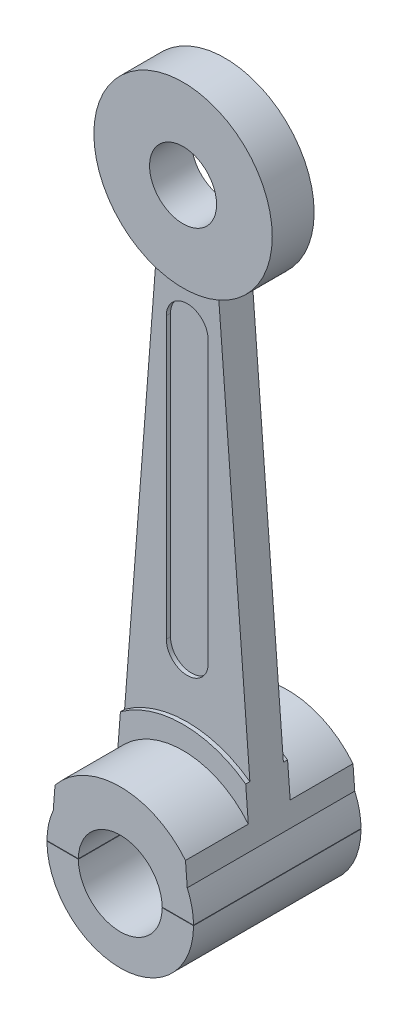
ISO-10303-21;
HEADER;
FILE_DESCRIPTION(('STEP AP214'),'2;1');
FILE_NAME('part.step','',(''),(''),'','','');
FILE_SCHEMA(('AUTOMOTIVE_DESIGN { 1 0 10303 214 1 1 1 1 }'));
ENDSEC;
DATA;
#1=APPLICATION_CONTEXT('core data for automotive mechanical design processes');
#2=APPLICATION_PROTOCOL_DEFINITION('international standard','automotive_design',2000,#1);
#3=PRODUCT_CONTEXT('',#1,'mechanical');
#4=PRODUCT('Part','Part','',(#3));
#5=PRODUCT_RELATED_PRODUCT_CATEGORY('part','',(#4));
#6=PRODUCT_DEFINITION_FORMATION('','',#4);
#7=PRODUCT_DEFINITION_CONTEXT('part definition',#1,'design');
#8=PRODUCT_DEFINITION('design','',#6,#7);
#9=PRODUCT_DEFINITION_SHAPE('','',#8);
#10=(LENGTH_UNIT() NAMED_UNIT(*) SI_UNIT(.MILLI.,.METRE.));
#11=(NAMED_UNIT(*) PLANE_ANGLE_UNIT() SI_UNIT($,.RADIAN.));
#12=(NAMED_UNIT(*) SI_UNIT($,.STERADIAN.) SOLID_ANGLE_UNIT());
#13=UNCERTAINTY_MEASURE_WITH_UNIT(LENGTH_MEASURE(1.E-05),#10,'distance_accuracy_value','');
#14=(GEOMETRIC_REPRESENTATION_CONTEXT(3) GLOBAL_UNCERTAINTY_ASSIGNED_CONTEXT((#13)) GLOBAL_UNIT_ASSIGNED_CONTEXT((#10,
#11,#12)) REPRESENTATION_CONTEXT('',''));
#15=CARTESIAN_POINT('',(0.,0.,0.));
#16=DIRECTION('',(0.,0.,1.));
#17=DIRECTION('',(1.,0.,0.));
#18=AXIS2_PLACEMENT_3D('',#15,#16,#17);
#19=CARTESIAN_POINT('',(0.,0.,-30.75));
#20=DIRECTION('',(0.,0.,1.));
#21=DIRECTION('',(1.,0.,0.));
#22=AXIS2_PLACEMENT_3D('',#19,#20,#21);
#23=CYLINDRICAL_SURFACE('',#22,1.75);
#24=CARTESIAN_POINT('',(0.,0.,-2.));
#25=DIRECTION('',(0.,0.,1.));
#26=DIRECTION('',(1.,0.,0.));
#27=AXIS2_PLACEMENT_3D('',#24,#25,#26);
#28=CIRCLE('',#27,1.75);
#29=CARTESIAN_POINT('',(-1.74997142833819,0.00999999999999941,-2.));
#30=VERTEX_POINT('',#29);
#31=CARTESIAN_POINT('',(-1.6,0.708872343937891,-2.));
#32=VERTEX_POINT('',#31);
#33=EDGE_CURVE('E266',#30,#32,#28,.F.);
#34=ORIENTED_EDGE('',*,*,#33,.F.);
#35=DIRECTION('',(0.,0.,1.));
#36=VECTOR('',#35,1.);
#37=CARTESIAN_POINT('',(-1.74997142833819,0.00999999999999941,-30.75));
#38=LINE('',#37,#36);
#39=CARTESIAN_POINT('',(-1.74997142833819,0.00999999999999941,2.));
#40=VERTEX_POINT('',#39);
#41=EDGE_CURVE('E301',#30,#40,#38,.T.);
#42=ORIENTED_EDGE('',*,*,#41,.T.);
#43=CARTESIAN_POINT('',(0.,0.,2.));
#44=DIRECTION('',(0.,0.,1.));
#45=DIRECTION('',(1.,0.,0.));
#46=AXIS2_PLACEMENT_3D('',#43,#44,#45);
#47=CIRCLE('',#46,1.75);
#48=CARTESIAN_POINT('',(-1.6,0.708872343937891,2.));
#49=VERTEX_POINT('',#48);
#50=EDGE_CURVE('E254',#40,#49,#47,.F.);
#51=ORIENTED_EDGE('',*,*,#50,.T.);
#52=DIRECTION('',(0.,0.,1.));
#53=VECTOR('',#52,1.);
#54=CARTESIAN_POINT('',(-1.6,0.708872343937891,-30.75));
#55=LINE('',#54,#53);
#56=EDGE_CURVE('E264',#32,#49,#55,.T.);
#57=ORIENTED_EDGE('',*,*,#56,.F.);
#58=EDGE_LOOP('',(#34,#42,#51,#57));
#59=FACE_BOUND('',#58,.T.);
#60=ADVANCED_FACE('F47',(#59),#23,.T.);
#61=CARTESIAN_POINT('',(0.,0.,0.5));
#62=DIRECTION('',(0.,0.,-1.));
#63=DIRECTION('',(-1.,0.,0.));
#64=AXIS2_PLACEMENT_3D('',#61,#62,#63);
#65=CYLINDRICAL_SURFACE('',#64,2.54);
#66=CARTESIAN_POINT('',(0.,0.,0.5));
#67=DIRECTION('',(0.,0.,1.));
#68=DIRECTION('',(1.,0.,0.));
#69=AXIS2_PLACEMENT_3D('',#66,#67,#68);
#70=CIRCLE('',#69,2.54);
#71=CARTESIAN_POINT('',(1.49604331072697,2.05267006906349,0.5));
#72=VERTEX_POINT('',#71);
#73=CARTESIAN_POINT('',(-1.49604331072697,2.05267006906349,0.5));
#74=VERTEX_POINT('',#73);
#75=EDGE_CURVE('E189',#72,#74,#70,.T.);
#76=ORIENTED_EDGE('',*,*,#75,.F.);
#77=DIRECTION('',(0.,0.,-1.));
#78=VECTOR('',#77,1.);
#79=CARTESIAN_POINT('',(1.49604331072697,2.05267006906349,0.5));
#80=LINE('',#79,#78);
#81=CARTESIAN_POINT('',(1.49604331072697,2.05267006906349,0.4));
#82=VERTEX_POINT('',#81);
#83=EDGE_CURVE('E251',#72,#82,#80,.T.);
#84=ORIENTED_EDGE('',*,*,#83,.T.);
#85=CARTESIAN_POINT('',(0.,0.,0.4));
#86=DIRECTION('',(0.,0.,1.));
#87=DIRECTION('',(1.,0.,0.));
#88=AXIS2_PLACEMENT_3D('',#85,#86,#87);
#89=CIRCLE('',#88,2.54);
#90=CARTESIAN_POINT('',(-1.49604331072697,2.05267006906349,0.4));
#91=VERTEX_POINT('',#90);
#92=EDGE_CURVE('E164',#82,#91,#89,.T.);
#93=ORIENTED_EDGE('',*,*,#92,.T.);
#94=DIRECTION('',(0.,0.,-1.));
#95=VECTOR('',#94,1.);
#96=CARTESIAN_POINT('',(-1.49604331072697,2.05267006906349,0.5));
#97=LINE('',#96,#95);
#98=EDGE_CURVE('E131',#91,#74,#97,.F.);
#99=ORIENTED_EDGE('',*,*,#98,.T.);
#100=EDGE_LOOP('',(#76,#84,#93,#99));
#101=FACE_BOUND('',#100,.T.);
#102=ADVANCED_FACE('F453',(#101),#65,.T.);
#103=CARTESIAN_POINT('',(0.,4.,0.4));
#104=DIRECTION('',(0.,0.,-1.));
#105=DIRECTION('',(-1.,0.,0.));
#106=AXIS2_PLACEMENT_3D('',#103,#104,#105);
#107=CYLINDRICAL_SURFACE('',#106,0.5);
#108=DIRECTION('',(0.,0.,-1.));
#109=VECTOR('',#108,1.);
#110=CARTESIAN_POINT('',(-0.499999999999999,4.,0.4));
#111=LINE('',#110,#109);
#112=CARTESIAN_POINT('',(-0.499999999999999,4.,-0.3));
#113=VERTEX_POINT('',#112);
#114=CARTESIAN_POINT('',(-0.499999999999999,4.,-0.4));
#115=VERTEX_POINT('',#114);
#116=EDGE_CURVE('E197',#113,#115,#111,.T.);
#117=ORIENTED_EDGE('',*,*,#116,.F.);
#118=CARTESIAN_POINT('',(0.,4.,-0.3));
#119=DIRECTION('',(0.,0.,1.));
#120=DIRECTION('',(1.,0.,0.));
#121=AXIS2_PLACEMENT_3D('',#118,#119,#120);
#122=CIRCLE('',#121,0.5);
#123=CARTESIAN_POINT('',(0.500000000000001,4.,-0.3));
#124=VERTEX_POINT('',#123);
#125=EDGE_CURVE('E203',#113,#124,#122,.T.);
#126=ORIENTED_EDGE('',*,*,#125,.T.);
#127=DIRECTION('',(0.,0.,-1.));
#128=VECTOR('',#127,1.);
#129=CARTESIAN_POINT('',(0.500000000000001,4.,0.4));
#130=LINE('',#129,#128);
#131=CARTESIAN_POINT('',(0.500000000000001,4.,-0.4));
#132=VERTEX_POINT('',#131);
#133=EDGE_CURVE('E206',#124,#132,#130,.T.);
#134=ORIENTED_EDGE('',*,*,#133,.T.);
#135=CARTESIAN_POINT('',(0.,4.,-0.4));
#136=DIRECTION('',(0.,0.,1.));
#137=DIRECTION('',(1.,0.,0.));
#138=AXIS2_PLACEMENT_3D('',#135,#136,#137);
#139=CIRCLE('',#138,0.5);
#140=EDGE_CURVE('E169',#115,#132,#139,.T.);
#141=ORIENTED_EDGE('',*,*,#140,.F.);
#142=EDGE_LOOP('',(#117,#126,#134,#141));
#143=FACE_BOUND('',#142,.T.);
#144=ADVANCED_FACE('F358',(#143),#107,.F.);
#145=CARTESIAN_POINT('',(-0.499999999999999,0.,0.4));
#146=DIRECTION('',(1.,0.,0.));
#147=DIRECTION('',(0.,1.,0.));
#148=AXIS2_PLACEMENT_3D('',#145,#146,#147);
#149=PLANE('',#148);
#150=DIRECTION('',(0.,0.,-1.));
#151=VECTOR('',#150,1.);
#152=CARTESIAN_POINT('',(-0.5,10.69,0.4));
#153=LINE('',#152,#151);
#154=CARTESIAN_POINT('',(-0.5,10.69,-0.3));
#155=VERTEX_POINT('',#154);
#156=CARTESIAN_POINT('',(-0.5,10.69,-0.4));
#157=VERTEX_POINT('',#156);
#158=EDGE_CURVE('E196',#155,#157,#153,.T.);
#159=ORIENTED_EDGE('',*,*,#158,.F.);
#160=DIRECTION('',(0.,-1.,0.));
#161=VECTOR('',#160,1.);
#162=CARTESIAN_POINT('',(-0.499999999999999,0.,-0.3));
#163=LINE('',#162,#161);
#164=EDGE_CURVE('E207',#155,#113,#163,.T.);
#165=ORIENTED_EDGE('',*,*,#164,.T.);
#166=ORIENTED_EDGE('',*,*,#116,.T.);
#167=DIRECTION('',(0.,-1.,0.));
#168=VECTOR('',#167,1.);
#169=CARTESIAN_POINT('',(-0.499999999999999,0.,-0.4));
#170=LINE('',#169,#168);
#171=EDGE_CURVE('E335',#157,#115,#170,.T.);
#172=ORIENTED_EDGE('',*,*,#171,.F.);
#173=EDGE_LOOP('',(#159,#165,#166,#172));
#174=FACE_BOUND('',#173,.T.);
#175=ADVANCED_FACE('F460',(#174),#149,.T.);
#176=CARTESIAN_POINT('',(0.,10.69,0.4));
#177=DIRECTION('',(0.,0.,-1.));
#178=DIRECTION('',(-1.,0.,0.));
#179=AXIS2_PLACEMENT_3D('',#176,#177,#178);
#180=CYLINDRICAL_SURFACE('',#179,0.5);
#181=DIRECTION('',(0.,0.,-1.));
#182=VECTOR('',#181,1.);
#183=CARTESIAN_POINT('',(0.5,10.69,0.4));
#184=LINE('',#183,#182);
#185=CARTESIAN_POINT('',(0.5,10.69,-0.3));
#186=VERTEX_POINT('',#185);
#187=CARTESIAN_POINT('',(0.5,10.69,-0.4));
#188=VERTEX_POINT('',#187);
#189=EDGE_CURVE('E329',#186,#188,#184,.T.);
#190=ORIENTED_EDGE('',*,*,#189,.F.);
#191=CARTESIAN_POINT('',(0.,10.69,-0.3));
#192=DIRECTION('',(0.,0.,1.));
#193=DIRECTION('',(1.,0.,0.));
#194=AXIS2_PLACEMENT_3D('',#191,#192,#193);
#195=CIRCLE('',#194,0.5);
#196=EDGE_CURVE('E193',#186,#155,#195,.T.);
#197=ORIENTED_EDGE('',*,*,#196,.T.);
#198=ORIENTED_EDGE('',*,*,#158,.T.);
#199=CARTESIAN_POINT('',(0.,10.69,-0.4));
#200=DIRECTION('',(0.,0.,1.));
#201=DIRECTION('',(1.,0.,0.));
#202=AXIS2_PLACEMENT_3D('',#199,#200,#201);
#203=CIRCLE('',#202,0.5);
#204=EDGE_CURVE('E338',#188,#157,#203,.T.);
#205=ORIENTED_EDGE('',*,*,#204,.F.);
#206=EDGE_LOOP('',(#190,#197,#198,#205));
#207=FACE_BOUND('',#206,.T.);
#208=ADVANCED_FACE('F487',(#207),#180,.F.);
#209=CARTESIAN_POINT('',(0.500000000000002,0.,0.4));
#210=DIRECTION('',(1.,0.,0.));
#211=DIRECTION('',(0.,1.,0.));
#212=AXIS2_PLACEMENT_3D('',#209,#210,#211);
#213=PLANE('',#212);
#214=DIRECTION('',(0.,-1.,0.));
#215=VECTOR('',#214,1.);
#216=CARTESIAN_POINT('',(0.500000000000002,0.,-0.3));
#217=LINE('',#216,#215);
#218=EDGE_CURVE('E198',#186,#124,#217,.T.);
#219=ORIENTED_EDGE('',*,*,#218,.F.);
#220=ORIENTED_EDGE('',*,*,#189,.T.);
#221=DIRECTION('',(0.,-1.,0.));
#222=VECTOR('',#221,1.);
#223=CARTESIAN_POINT('',(0.500000000000002,0.,-0.4));
#224=LINE('',#223,#222);
#225=EDGE_CURVE('E160',#188,#132,#224,.T.);
#226=ORIENTED_EDGE('',*,*,#225,.T.);
#227=ORIENTED_EDGE('',*,*,#133,.F.);
#228=EDGE_LOOP('',(#219,#220,#226,#227));
#229=FACE_BOUND('',#228,.T.);
#230=ADVANCED_FACE('F482',(#229),#213,.F.);
#231=CARTESIAN_POINT('',(0.,13.69,0.5));
#232=DIRECTION('',(0.,0.,-1.));
#233=DIRECTION('',(-1.,0.,0.));
#234=AXIS2_PLACEMENT_3D('',#231,#232,#233);
#235=CYLINDRICAL_SURFACE('',#234,0.8);
#236=CARTESIAN_POINT('',(0.,13.69,0.5));
#237=DIRECTION('',(0.,0.,1.));
#238=DIRECTION('',(1.,0.,0.));
#239=AXIS2_PLACEMENT_3D('',#236,#237,#238);
#240=CIRCLE('',#239,0.8);
#241=CARTESIAN_POINT('',(0.8,13.69,0.5));
#242=VERTEX_POINT('',#241);
#243=EDGE_CURVE('E155',#242,#242,#240,.T.);
#244=ORIENTED_EDGE('',*,*,#243,.T.);
#245=EDGE_LOOP('',(#244));
#246=FACE_BOUND('',#245,.T.);
#247=CARTESIAN_POINT('',(0.,13.69,-0.5));
#248=DIRECTION('',(0.,0.,1.));
#249=DIRECTION('',(1.,0.,0.));
#250=AXIS2_PLACEMENT_3D('',#247,#248,#249);
#251=CIRCLE('',#250,0.8);
#252=CARTESIAN_POINT('',(0.8,13.69,-0.5));
#253=VERTEX_POINT('',#252);
#254=EDGE_CURVE('E183',#253,#253,#251,.T.);
#255=ORIENTED_EDGE('',*,*,#254,.F.);
#256=EDGE_LOOP('',(#255));
#257=FACE_BOUND('',#256,.T.);
#258=ADVANCED_FACE('F503',(#246,#257),#235,.F.);
#259=CARTESIAN_POINT('',(0.,13.69,0.5));
#260=DIRECTION('',(0.,0.,-1.));
#261=DIRECTION('',(-1.,0.,0.));
#262=AXIS2_PLACEMENT_3D('',#259,#260,#261);
#263=CYLINDRICAL_SURFACE('',#262,2.13);
#264=CARTESIAN_POINT('',(0.,13.69,0.4));
#265=DIRECTION('',(0.,0.,1.));
#266=DIRECTION('',(1.,0.,0.));
#267=AXIS2_PLACEMENT_3D('',#264,#265,#266);
#268=CIRCLE('',#267,2.13);
#269=CARTESIAN_POINT('',(-0.75,11.6964102728997,0.400000000000001));
#270=VERTEX_POINT('',#269);
#271=CARTESIAN_POINT('',(0.75,11.6964102728997,0.400000000000001));
#272=VERTEX_POINT('',#271);
#273=EDGE_CURVE('E145',#270,#272,#268,.T.);
#274=ORIENTED_EDGE('',*,*,#273,.T.);
#275=DIRECTION('',(0.,0.,-1.));
#276=VECTOR('',#275,1.);
#277=CARTESIAN_POINT('',(0.75,11.6964102728997,0.4));
#278=LINE('',#277,#276);
#279=CARTESIAN_POINT('',(0.75,11.6964102728997,-0.400000000000001));
#280=VERTEX_POINT('',#279);
#281=EDGE_CURVE('E154',#272,#280,#278,.T.);
#282=ORIENTED_EDGE('',*,*,#281,.T.);
#283=CARTESIAN_POINT('',(0.,13.69,-0.4));
#284=DIRECTION('',(0.,0.,1.));
#285=DIRECTION('',(1.,0.,0.));
#286=AXIS2_PLACEMENT_3D('',#283,#284,#285);
#287=CIRCLE('',#286,2.13);
#288=CARTESIAN_POINT('',(-0.75,11.6964102728997,-0.400000000000001));
#289=VERTEX_POINT('',#288);
#290=EDGE_CURVE('E147',#289,#280,#287,.T.);
#291=ORIENTED_EDGE('',*,*,#290,.F.);
#292=DIRECTION('',(0.,0.,-1.));
#293=VECTOR('',#292,1.);
#294=CARTESIAN_POINT('',(-0.75,11.6964102728997,0.4));
#295=LINE('',#294,#293);
#296=EDGE_CURVE('E129',#270,#289,#295,.T.);
#297=ORIENTED_EDGE('',*,*,#296,.F.);
#298=EDGE_LOOP('',(#274,#282,#291,#297));
#299=FACE_BOUND('',#298,.T.);
#300=CARTESIAN_POINT('',(0.,13.69,-0.5));
#301=DIRECTION('',(0.,0.,1.));
#302=DIRECTION('',(1.,0.,0.));
#303=AXIS2_PLACEMENT_3D('',#300,#301,#302);
#304=CIRCLE('',#303,2.13);
#305=CARTESIAN_POINT('',(2.13,13.69,-0.5));
#306=VERTEX_POINT('',#305);
#307=EDGE_CURVE('E157',#306,#306,#304,.T.);
#308=ORIENTED_EDGE('',*,*,#307,.T.);
#309=EDGE_LOOP('',(#308));
#310=FACE_BOUND('',#309,.T.);
#311=CARTESIAN_POINT('',(0.,13.69,0.5));
#312=DIRECTION('',(0.,0.,1.));
#313=DIRECTION('',(1.,0.,0.));
#314=AXIS2_PLACEMENT_3D('',#311,#312,#313);
#315=CIRCLE('',#314,2.13);
#316=CARTESIAN_POINT('',(2.13,13.69,0.5));
#317=VERTEX_POINT('',#316);
#318=EDGE_CURVE('E318',#317,#317,#315,.T.);
#319=ORIENTED_EDGE('',*,*,#318,.F.);
#320=EDGE_LOOP('',(#319));
#321=FACE_BOUND('',#320,.T.);
#322=ADVANCED_FACE('F141',(#299,#310,#321),#263,.T.);
#323=CARTESIAN_POINT('',(0.,0.,0.5));
#324=DIRECTION('',(0.,0.,1.));
#325=DIRECTION('',(1.,0.,0.));
#326=AXIS2_PLACEMENT_3D('',#323,#324,#325);
#327=PLANE('',#326);
#328=ORIENTED_EDGE('',*,*,#243,.F.);
#329=EDGE_LOOP('',(#328));
#330=FACE_BOUND('',#329,.T.);
#331=ORIENTED_EDGE('',*,*,#318,.T.);
#332=EDGE_LOOP('',(#331));
#333=FACE_BOUND('',#332,.T.);
#334=ADVANCED_FACE('F494',(#330,#333),#327,.T.);
#335=CARTESIAN_POINT('',(0.,0.,-0.5));
#336=DIRECTION('',(0.,0.,1.));
#337=DIRECTION('',(1.,0.,0.));
#338=AXIS2_PLACEMENT_3D('',#335,#336,#337);
#339=PLANE('',#338);
#340=ORIENTED_EDGE('',*,*,#254,.T.);
#341=EDGE_LOOP('',(#340));
#342=FACE_BOUND('',#341,.T.);
#343=ORIENTED_EDGE('',*,*,#307,.F.);
#344=EDGE_LOOP('',(#343));
#345=FACE_BOUND('',#344,.T.);
#346=ADVANCED_FACE('F492',(#342,#345),#339,.F.);
#347=CARTESIAN_POINT('',(0.,4.,0.3));
#348=DIRECTION('',(0.,0.,1.));
#349=DIRECTION('',(1.,0.,0.));
#350=AXIS2_PLACEMENT_3D('',#347,#348,#349);
#351=CIRCLE('',#350,0.5);
#352=CARTESIAN_POINT('',(-0.499999999999999,4.,0.3));
#353=VERTEX_POINT('',#352);
#354=CARTESIAN_POINT('',(0.500000000000001,4.,0.3));
#355=VERTEX_POINT('',#354);
#356=EDGE_CURVE('E214',#353,#355,#351,.T.);
#357=ORIENTED_EDGE('',*,*,#356,.F.);
#358=CARTESIAN_POINT('',(-0.499999999999999,4.,0.4));
#359=VERTEX_POINT('',#358);
#360=EDGE_CURVE('E175',#359,#353,#111,.T.);
#361=ORIENTED_EDGE('',*,*,#360,.F.);
#362=CARTESIAN_POINT('',(0.,4.,0.4));
#363=DIRECTION('',(0.,0.,1.));
#364=DIRECTION('',(1.,0.,0.));
#365=AXIS2_PLACEMENT_3D('',#362,#363,#364);
#366=CIRCLE('',#365,0.5);
#367=CARTESIAN_POINT('',(0.500000000000001,4.,0.4));
#368=VERTEX_POINT('',#367);
#369=EDGE_CURVE('E180',#359,#368,#366,.T.);
#370=ORIENTED_EDGE('',*,*,#369,.T.);
#371=EDGE_CURVE('E179',#368,#355,#130,.T.);
#372=ORIENTED_EDGE('',*,*,#371,.T.);
#373=EDGE_LOOP('',(#357,#361,#370,#372));
#374=FACE_BOUND('',#373,.T.);
#375=ADVANCED_FACE('F462',(#374),#107,.F.);
#376=DIRECTION('',(0.,-1.,0.));
#377=VECTOR('',#376,1.);
#378=CARTESIAN_POINT('',(-0.499999999999999,0.,0.3));
#379=LINE('',#378,#377);
#380=CARTESIAN_POINT('',(-0.5,10.69,0.3));
#381=VERTEX_POINT('',#380);
#382=EDGE_CURVE('E201',#381,#353,#379,.T.);
#383=ORIENTED_EDGE('',*,*,#382,.F.);
#384=CARTESIAN_POINT('',(-0.5,10.69,0.4));
#385=VERTEX_POINT('',#384);
#386=EDGE_CURVE('E174',#385,#381,#153,.T.);
#387=ORIENTED_EDGE('',*,*,#386,.F.);
#388=DIRECTION('',(0.,-1.,0.));
#389=VECTOR('',#388,1.);
#390=CARTESIAN_POINT('',(-0.499999999999999,0.,0.4));
#391=LINE('',#390,#389);
#392=EDGE_CURVE('E176',#385,#359,#391,.T.);
#393=ORIENTED_EDGE('',*,*,#392,.T.);
#394=ORIENTED_EDGE('',*,*,#360,.T.);
#395=EDGE_LOOP('',(#383,#387,#393,#394));
#396=FACE_BOUND('',#395,.T.);
#397=ADVANCED_FACE('F485',(#396),#149,.T.);
#398=CARTESIAN_POINT('',(0.,10.69,0.3));
#399=DIRECTION('',(0.,0.,1.));
#400=DIRECTION('',(1.,0.,0.));
#401=AXIS2_PLACEMENT_3D('',#398,#399,#400);
#402=CIRCLE('',#401,0.5);
#403=CARTESIAN_POINT('',(0.5,10.69,0.3));
#404=VERTEX_POINT('',#403);
#405=EDGE_CURVE('E210',#404,#381,#402,.T.);
#406=ORIENTED_EDGE('',*,*,#405,.F.);
#407=CARTESIAN_POINT('',(0.5,10.69,0.4));
#408=VERTEX_POINT('',#407);
#409=EDGE_CURVE('E217',#408,#404,#184,.T.);
#410=ORIENTED_EDGE('',*,*,#409,.F.);
#411=CARTESIAN_POINT('',(0.,10.69,0.4));
#412=DIRECTION('',(0.,0.,1.));
#413=DIRECTION('',(1.,0.,0.));
#414=AXIS2_PLACEMENT_3D('',#411,#412,#413);
#415=CIRCLE('',#414,0.5);
#416=EDGE_CURVE('E171',#408,#385,#415,.T.);
#417=ORIENTED_EDGE('',*,*,#416,.T.);
#418=ORIENTED_EDGE('',*,*,#386,.T.);
#419=EDGE_LOOP('',(#406,#410,#417,#418));
#420=FACE_BOUND('',#419,.T.);
#421=ADVANCED_FACE('F480',(#420),#180,.F.);
#422=ORIENTED_EDGE('',*,*,#409,.T.);
#423=DIRECTION('',(0.,-1.,0.));
#424=VECTOR('',#423,1.);
#425=CARTESIAN_POINT('',(0.500000000000002,0.,0.3));
#426=LINE('',#425,#424);
#427=EDGE_CURVE('E170',#404,#355,#426,.T.);
#428=ORIENTED_EDGE('',*,*,#427,.T.);
#429=ORIENTED_EDGE('',*,*,#371,.F.);
#430=DIRECTION('',(0.,-1.,0.));
#431=VECTOR('',#430,1.);
#432=CARTESIAN_POINT('',(0.500000000000002,0.,0.4));
#433=LINE('',#432,#431);
#434=EDGE_CURVE('E166',#408,#368,#433,.T.);
#435=ORIENTED_EDGE('',*,*,#434,.F.);
#436=EDGE_LOOP('',(#422,#428,#429,#435));
#437=FACE_BOUND('',#436,.T.);
#438=ADVANCED_FACE('F476',(#437),#213,.F.);
#439=CARTESIAN_POINT('',(0.,0.,0.4));
#440=DIRECTION('',(0.,0.,1.));
#441=DIRECTION('',(1.,0.,0.));
#442=AXIS2_PLACEMENT_3D('',#439,#440,#441);
#443=PLANE('',#442);
#444=DIRECTION('',(0.0771299174302122,-0.997021050849584,0.));
#445=VECTOR('',#444,1.);
#446=CARTESIAN_POINT('',(1.64499395186074,0.12725734082756,0.4));
#447=LINE('',#446,#445);
#448=EDGE_CURVE('E153',#272,#82,#447,.T.);
#449=ORIENTED_EDGE('',*,*,#448,.F.);
#450=ORIENTED_EDGE('',*,*,#273,.F.);
#451=DIRECTION('',(0.0771299174302122,0.997021050849584,0.));
#452=VECTOR('',#451,1.);
#453=CARTESIAN_POINT('',(-1.64499395186074,0.12725734082756,0.4));
#454=LINE('',#453,#452);
#455=EDGE_CURVE('E126',#91,#270,#454,.T.);
#456=ORIENTED_EDGE('',*,*,#455,.F.);
#457=ORIENTED_EDGE('',*,*,#92,.F.);
#458=EDGE_LOOP('',(#449,#450,#456,#457));
#459=FACE_BOUND('',#458,.T.);
#460=ORIENTED_EDGE('',*,*,#369,.F.);
#461=ORIENTED_EDGE('',*,*,#392,.F.);
#462=ORIENTED_EDGE('',*,*,#416,.F.);
#463=ORIENTED_EDGE('',*,*,#434,.T.);
#464=EDGE_LOOP('',(#460,#461,#462,#463));
#465=FACE_BOUND('',#464,.T.);
#466=ADVANCED_FACE('F150',(#459,#465),#443,.T.);
#467=CARTESIAN_POINT('',(0.,0.,-0.4));
#468=DIRECTION('',(0.,0.,1.));
#469=DIRECTION('',(1.,0.,0.));
#470=AXIS2_PLACEMENT_3D('',#467,#468,#469);
#471=PLANE('',#470);
#472=ORIENTED_EDGE('',*,*,#140,.T.);
#473=ORIENTED_EDGE('',*,*,#225,.F.);
#474=ORIENTED_EDGE('',*,*,#204,.T.);
#475=ORIENTED_EDGE('',*,*,#171,.T.);
#476=EDGE_LOOP('',(#472,#473,#474,#475));
#477=FACE_BOUND('',#476,.T.);
#478=ORIENTED_EDGE('',*,*,#290,.T.);
#479=DIRECTION('',(0.0771299174302122,-0.997021050849584,0.));
#480=VECTOR('',#479,1.);
#481=CARTESIAN_POINT('',(1.64499395186074,0.12725734082756,-0.4));
#482=LINE('',#481,#480);
#483=CARTESIAN_POINT('',(1.49604331072697,2.05267006906349,-0.4));
#484=VERTEX_POINT('',#483);
#485=EDGE_CURVE('E232',#280,#484,#482,.T.);
#486=ORIENTED_EDGE('',*,*,#485,.T.);
#487=CARTESIAN_POINT('',(0.,0.,-0.4));
#488=DIRECTION('',(0.,0.,1.));
#489=DIRECTION('',(1.,0.,0.));
#490=AXIS2_PLACEMENT_3D('',#487,#488,#489);
#491=CIRCLE('',#490,2.54);
#492=CARTESIAN_POINT('',(-1.49604331072697,2.05267006906349,-0.4));
#493=VERTEX_POINT('',#492);
#494=EDGE_CURVE('E235',#484,#493,#491,.T.);
#495=ORIENTED_EDGE('',*,*,#494,.T.);
#496=DIRECTION('',(0.0771299174302122,0.997021050849584,0.));
#497=VECTOR('',#496,1.);
#498=CARTESIAN_POINT('',(-1.64499395186074,0.12725734082756,-0.4));
#499=LINE('',#498,#497);
#500=EDGE_CURVE('E97',#493,#289,#499,.T.);
#501=ORIENTED_EDGE('',*,*,#500,.T.);
#502=EDGE_LOOP('',(#478,#486,#495,#501));
#503=FACE_BOUND('',#502,.T.);
#504=ADVANCED_FACE('F347',(#477,#503),#471,.F.);
#505=ORIENTED_EDGE('',*,*,#494,.F.);
#506=CARTESIAN_POINT('',(1.49604331072697,2.05267006906349,-0.5));
#507=VERTEX_POINT('',#506);
#508=EDGE_CURVE('E188',#484,#507,#80,.T.);
#509=ORIENTED_EDGE('',*,*,#508,.T.);
#510=CARTESIAN_POINT('',(0.,0.,-0.5));
#511=DIRECTION('',(0.,0.,1.));
#512=DIRECTION('',(1.,0.,0.));
#513=AXIS2_PLACEMENT_3D('',#510,#511,#512);
#514=CIRCLE('',#513,2.54);
#515=CARTESIAN_POINT('',(-1.49604331072697,2.05267006906349,-0.5));
#516=VERTEX_POINT('',#515);
#517=EDGE_CURVE('E184',#507,#516,#514,.T.);
#518=ORIENTED_EDGE('',*,*,#517,.T.);
#519=EDGE_CURVE('E187',#516,#493,#97,.F.);
#520=ORIENTED_EDGE('',*,*,#519,.T.);
#521=EDGE_LOOP('',(#505,#509,#518,#520));
#522=FACE_BOUND('',#521,.T.);
#523=ADVANCED_FACE('F423',(#522),#65,.T.);
#524=CARTESIAN_POINT('',(0.,0.,0.5));
#525=DIRECTION('',(0.,0.,1.));
#526=DIRECTION('',(1.,0.,0.));
#527=AXIS2_PLACEMENT_3D('',#524,#525,#526);
#528=PLANE('',#527);
#529=DIRECTION('',(0.0771299174302122,-0.997021050849584,0.));
#530=VECTOR('',#529,1.);
#531=CARTESIAN_POINT('',(1.64499395186074,0.12725734082756,0.5));
#532=LINE('',#531,#530);
#533=CARTESIAN_POINT('',(1.5578064191702,1.25428830832154,0.5));
#534=VERTEX_POINT('',#533);
#535=EDGE_CURVE('E249',#72,#534,#532,.T.);
#536=ORIENTED_EDGE('',*,*,#535,.F.);
#537=ORIENTED_EDGE('',*,*,#75,.T.);
#538=DIRECTION('',(0.0771299174302122,0.997021050849584,0.));
#539=VECTOR('',#538,1.);
#540=CARTESIAN_POINT('',(-1.64499395186074,0.12725734082756,0.5));
#541=LINE('',#540,#539);
#542=CARTESIAN_POINT('',(-1.5578064191702,1.25428830832154,0.5));
#543=VERTEX_POINT('',#542);
#544=EDGE_CURVE('E136',#543,#74,#541,.T.);
#545=ORIENTED_EDGE('',*,*,#544,.F.);
#546=CARTESIAN_POINT('',(0.,0.,0.5));
#547=DIRECTION('',(0.,0.,1.));
#548=DIRECTION('',(1.,0.,0.));
#549=AXIS2_PLACEMENT_3D('',#546,#547,#548);
#550=CIRCLE('',#549,2.);
#551=EDGE_CURVE('E222',#534,#543,#550,.T.);
#552=ORIENTED_EDGE('',*,*,#551,.F.);
#553=EDGE_LOOP('',(#536,#537,#545,#552));
#554=FACE_BOUND('',#553,.T.);
#555=ADVANCED_FACE('F450',(#554),#528,.T.);
#556=CARTESIAN_POINT('',(0.,0.,-0.5));
#557=DIRECTION('',(0.,0.,1.));
#558=DIRECTION('',(1.,0.,0.));
#559=AXIS2_PLACEMENT_3D('',#556,#557,#558);
#560=PLANE('',#559);
#561=ORIENTED_EDGE('',*,*,#517,.F.);
#562=DIRECTION('',(0.0771299174302122,-0.997021050849584,0.));
#563=VECTOR('',#562,1.);
#564=CARTESIAN_POINT('',(1.64499395186074,0.12725734082756,-0.5));
#565=LINE('',#564,#563);
#566=CARTESIAN_POINT('',(1.5578064191702,1.25428830832154,-0.5));
#567=VERTEX_POINT('',#566);
#568=EDGE_CURVE('E192',#507,#567,#565,.T.);
#569=ORIENTED_EDGE('',*,*,#568,.T.);
#570=CARTESIAN_POINT('',(0.,0.,-0.5));
#571=DIRECTION('',(0.,0.,1.));
#572=DIRECTION('',(1.,0.,0.));
#573=AXIS2_PLACEMENT_3D('',#570,#571,#572);
#574=CIRCLE('',#573,2.);
#575=CARTESIAN_POINT('',(-1.5578064191702,1.25428830832154,-0.5));
#576=VERTEX_POINT('',#575);
#577=EDGE_CURVE('E238',#567,#576,#574,.T.);
#578=ORIENTED_EDGE('',*,*,#577,.T.);
#579=DIRECTION('',(0.0771299174302122,0.997021050849584,0.));
#580=VECTOR('',#579,1.);
#581=CARTESIAN_POINT('',(-1.64499395186074,0.12725734082756,-0.5));
#582=LINE('',#581,#580);
#583=EDGE_CURVE('E202',#576,#516,#582,.T.);
#584=ORIENTED_EDGE('',*,*,#583,.T.);
#585=EDGE_LOOP('',(#561,#569,#578,#584));
#586=FACE_BOUND('',#585,.T.);
#587=ADVANCED_FACE('F427',(#586),#560,.F.);
#588=CARTESIAN_POINT('',(0.,0.,-0.3));
#589=DIRECTION('',(0.,0.,1.));
#590=DIRECTION('',(1.,0.,0.));
#591=AXIS2_PLACEMENT_3D('',#588,#589,#590);
#592=PLANE('',#591);
#593=ORIENTED_EDGE('',*,*,#164,.F.);
#594=ORIENTED_EDGE('',*,*,#196,.F.);
#595=ORIENTED_EDGE('',*,*,#218,.T.);
#596=ORIENTED_EDGE('',*,*,#125,.F.);
#597=EDGE_LOOP('',(#593,#594,#595,#596));
#598=FACE_BOUND('',#597,.T.);
#599=ADVANCED_FACE('F532',(#598),#592,.F.);
#600=CARTESIAN_POINT('',(0.,0.,0.3));
#601=DIRECTION('',(0.,0.,1.));
#602=DIRECTION('',(1.,0.,0.));
#603=AXIS2_PLACEMENT_3D('',#600,#601,#602);
#604=PLANE('',#603);
#605=ORIENTED_EDGE('',*,*,#382,.T.);
#606=ORIENTED_EDGE('',*,*,#356,.T.);
#607=ORIENTED_EDGE('',*,*,#427,.F.);
#608=ORIENTED_EDGE('',*,*,#405,.T.);
#609=EDGE_LOOP('',(#605,#606,#607,#608));
#610=FACE_BOUND('',#609,.T.);
#611=ADVANCED_FACE('F628',(#610),#604,.T.);
#612=CARTESIAN_POINT('',(0.,0.,-2.));
#613=DIRECTION('',(0.,0.,1.));
#614=DIRECTION('',(1.,0.,0.));
#615=AXIS2_PLACEMENT_3D('',#612,#613,#614);
#616=CYLINDRICAL_SURFACE('',#615,2.);
#617=DIRECTION('',(0.,0.,1.));
#618=VECTOR('',#617,1.);
#619=CARTESIAN_POINT('',(1.5578064191702,1.25428830832154,-2.));
#620=LINE('',#619,#618);
#621=CARTESIAN_POINT('',(1.5578064191702,1.25428830832154,-2.));
#622=VERTEX_POINT('',#621);
#623=EDGE_CURVE('E239',#622,#567,#620,.T.);
#624=ORIENTED_EDGE('',*,*,#623,.F.);
#625=CARTESIAN_POINT('',(0.,0.,-2.));
#626=DIRECTION('',(0.,0.,1.));
#627=DIRECTION('',(1.,0.,0.));
#628=AXIS2_PLACEMENT_3D('',#625,#626,#627);
#629=CIRCLE('',#628,2.);
#630=CARTESIAN_POINT('',(-1.5578064191702,1.25428830832154,-2.));
#631=VERTEX_POINT('',#630);
#632=EDGE_CURVE('E213',#622,#631,#629,.T.);
#633=ORIENTED_EDGE('',*,*,#632,.T.);
#634=DIRECTION('',(0.,0.,1.));
#635=VECTOR('',#634,1.);
#636=CARTESIAN_POINT('',(-1.5578064191702,1.25428830832154,-2.));
#637=LINE('',#636,#635);
#638=EDGE_CURVE('E242',#576,#631,#637,.F.);
#639=ORIENTED_EDGE('',*,*,#638,.F.);
#640=ORIENTED_EDGE('',*,*,#577,.F.);
#641=EDGE_LOOP('',(#624,#633,#639,#640));
#642=FACE_BOUND('',#641,.T.);
#643=ADVANCED_FACE('F431',(#642),#616,.T.);
#644=CARTESIAN_POINT('',(0.,0.,-2.));
#645=DIRECTION('',(0.,0.,1.));
#646=DIRECTION('',(1.,0.,0.));
#647=AXIS2_PLACEMENT_3D('',#644,#645,#646);
#648=PLANE('',#647);
#649=CARTESIAN_POINT('',(1.6,0.708872343937891,-2.));
#650=VERTEX_POINT('',#649);
#651=CARTESIAN_POINT('',(1.74997142833819,0.00999999999999978,-2.));
#652=VERTEX_POINT('',#651);
#653=EDGE_CURVE('E51',#650,#652,#28,.F.);
#654=ORIENTED_EDGE('',*,*,#653,.T.);
#655=DIRECTION('',(-1.,0.,0.));
#656=VECTOR('',#655,1.);
#657=CARTESIAN_POINT('',(0.,0.0099999999999996,-2.));
#658=LINE('',#657,#656);
#659=CARTESIAN_POINT('',(0.999949998749938,0.0099999999999997,-2.));
#660=VERTEX_POINT('',#659);
#661=EDGE_CURVE('E279',#652,#660,#658,.T.);
#662=ORIENTED_EDGE('',*,*,#661,.T.);
#663=CARTESIAN_POINT('',(0.,0.,-2.));
#664=DIRECTION('',(0.,0.,1.));
#665=DIRECTION('',(1.,0.,0.));
#666=AXIS2_PLACEMENT_3D('',#663,#664,#665);
#667=CIRCLE('',#666,1.);
#668=CARTESIAN_POINT('',(-0.999949998749938,0.00999999999999949,-2.));
#669=VERTEX_POINT('',#668);
#670=EDGE_CURVE('E282',#660,#669,#667,.T.);
#671=ORIENTED_EDGE('',*,*,#670,.T.);
#672=EDGE_CURVE('E67',#669,#30,#658,.T.);
#673=ORIENTED_EDGE('',*,*,#672,.T.);
#674=ORIENTED_EDGE('',*,*,#33,.T.);
#675=DIRECTION('',(0.0771299174302122,0.997021050849584,0.));
#676=VECTOR('',#675,1.);
#677=CARTESIAN_POINT('',(-1.64499395186074,0.12725734082756,-2.));
#678=LINE('',#677,#676);
#679=EDGE_CURVE('E247',#32,#631,#678,.T.);
#680=ORIENTED_EDGE('',*,*,#679,.T.);
#681=ORIENTED_EDGE('',*,*,#632,.F.);
#682=DIRECTION('',(0.0771299174302122,-0.997021050849584,0.));
#683=VECTOR('',#682,1.);
#684=CARTESIAN_POINT('',(1.64499395186074,0.12725734082756,-2.));
#685=LINE('',#684,#683);
#686=EDGE_CURVE('E244',#622,#650,#685,.T.);
#687=ORIENTED_EDGE('',*,*,#686,.T.);
#688=EDGE_LOOP('',(#654,#662,#671,#673,#674,#680,#681,#687));
#689=FACE_BOUND('',#688,.T.);
#690=ADVANCED_FACE('F49',(#689),#648,.F.);
#691=CARTESIAN_POINT('',(0.,0.,0.5));
#692=DIRECTION('',(0.,0.,-1.));
#693=DIRECTION('',(-1.,0.,0.));
#694=AXIS2_PLACEMENT_3D('',#691,#692,#693);
#695=CYLINDRICAL_SURFACE('',#694,1.);
#696=DIRECTION('',(0.,0.,-1.));
#697=VECTOR('',#696,1.);
#698=CARTESIAN_POINT('',(0.999949998749938,0.0099999999999997,0.5));
#699=LINE('',#698,#697);
#700=CARTESIAN_POINT('',(0.999949998749938,0.0099999999999997,2.));
#701=VERTEX_POINT('',#700);
#702=EDGE_CURVE('E278',#701,#660,#699,.T.);
#703=ORIENTED_EDGE('',*,*,#702,.F.);
#704=CARTESIAN_POINT('',(0.,0.,2.));
#705=DIRECTION('',(0.,0.,1.));
#706=DIRECTION('',(1.,0.,0.));
#707=AXIS2_PLACEMENT_3D('',#704,#705,#706);
#708=CIRCLE('',#707,1.);
#709=CARTESIAN_POINT('',(-0.999949998749938,0.00999999999999949,2.));
#710=VERTEX_POINT('',#709);
#711=EDGE_CURVE('E226',#701,#710,#708,.T.);
#712=ORIENTED_EDGE('',*,*,#711,.T.);
#713=DIRECTION('',(0.,0.,-1.));
#714=VECTOR('',#713,1.);
#715=CARTESIAN_POINT('',(-0.999949998749938,0.00999999999999949,0.5));
#716=LINE('',#715,#714);
#717=EDGE_CURVE('E57',#669,#710,#716,.F.);
#718=ORIENTED_EDGE('',*,*,#717,.F.);
#719=ORIENTED_EDGE('',*,*,#670,.F.);
#720=EDGE_LOOP('',(#703,#712,#718,#719));
#721=FACE_BOUND('',#720,.T.);
#722=ADVANCED_FACE('F290',(#721),#695,.F.);
#723=DIRECTION('',(0.,0.,1.));
#724=VECTOR('',#723,1.);
#725=CARTESIAN_POINT('',(1.5578064191702,1.25428830832154,-2.));
#726=LINE('',#725,#724);
#727=CARTESIAN_POINT('',(1.5578064191702,1.25428830832154,2.));
#728=VERTEX_POINT('',#727);
#729=EDGE_CURVE('E257',#534,#728,#726,.T.);
#730=ORIENTED_EDGE('',*,*,#729,.F.);
#731=ORIENTED_EDGE('',*,*,#551,.T.);
#732=DIRECTION('',(0.,0.,1.));
#733=VECTOR('',#732,1.);
#734=CARTESIAN_POINT('',(-1.5578064191702,1.25428830832154,-2.));
#735=LINE('',#734,#733);
#736=CARTESIAN_POINT('',(-1.5578064191702,1.25428830832154,2.));
#737=VERTEX_POINT('',#736);
#738=EDGE_CURVE('E270',#737,#543,#735,.F.);
#739=ORIENTED_EDGE('',*,*,#738,.F.);
#740=CARTESIAN_POINT('',(0.,0.,2.));
#741=DIRECTION('',(0.,0.,1.));
#742=DIRECTION('',(1.,0.,0.));
#743=AXIS2_PLACEMENT_3D('',#740,#741,#742);
#744=CIRCLE('',#743,2.);
#745=EDGE_CURVE('E225',#728,#737,#744,.T.);
#746=ORIENTED_EDGE('',*,*,#745,.F.);
#747=EDGE_LOOP('',(#730,#731,#739,#746));
#748=FACE_BOUND('',#747,.T.);
#749=ADVANCED_FACE('F445',(#748),#616,.T.);
#750=CARTESIAN_POINT('',(0.,0.,2.));
#751=DIRECTION('',(0.,0.,1.));
#752=DIRECTION('',(1.,0.,0.));
#753=AXIS2_PLACEMENT_3D('',#750,#751,#752);
#754=PLANE('',#753);
#755=DIRECTION('',(-1.,0.,0.));
#756=VECTOR('',#755,1.);
#757=CARTESIAN_POINT('',(0.,0.0099999999999996,2.));
#758=LINE('',#757,#756);
#759=CARTESIAN_POINT('',(1.74997142833819,0.00999999999999978,2.));
#760=VERTEX_POINT('',#759);
#761=EDGE_CURVE('E59',#760,#701,#758,.T.);
#762=ORIENTED_EDGE('',*,*,#761,.F.);
#763=CARTESIAN_POINT('',(1.6,0.708872343937891,2.));
#764=VERTEX_POINT('',#763);
#765=EDGE_CURVE('E231',#764,#760,#47,.F.);
#766=ORIENTED_EDGE('',*,*,#765,.F.);
#767=DIRECTION('',(0.0771299174302122,-0.997021050849584,0.));
#768=VECTOR('',#767,1.);
#769=CARTESIAN_POINT('',(1.64499395186074,0.12725734082756,2.));
#770=LINE('',#769,#768);
#771=EDGE_CURVE('E243',#728,#764,#770,.T.);
#772=ORIENTED_EDGE('',*,*,#771,.F.);
#773=ORIENTED_EDGE('',*,*,#745,.T.);
#774=DIRECTION('',(0.0771299174302122,0.997021050849584,0.));
#775=VECTOR('',#774,1.);
#776=CARTESIAN_POINT('',(-1.64499395186074,0.12725734082756,2.));
#777=LINE('',#776,#775);
#778=EDGE_CURVE('E272',#49,#737,#777,.T.);
#779=ORIENTED_EDGE('',*,*,#778,.F.);
#780=ORIENTED_EDGE('',*,*,#50,.F.);
#781=EDGE_CURVE('E12',#710,#40,#758,.T.);
#782=ORIENTED_EDGE('',*,*,#781,.F.);
#783=ORIENTED_EDGE('',*,*,#711,.F.);
#784=EDGE_LOOP('',(#762,#766,#772,#773,#779,#780,#782,#783));
#785=FACE_BOUND('',#784,.T.);
#786=ADVANCED_FACE('F294',(#785),#754,.T.);
#787=ORIENTED_EDGE('',*,*,#765,.T.);
#788=DIRECTION('',(0.,0.,1.));
#789=VECTOR('',#788,1.);
#790=CARTESIAN_POINT('',(1.74997142833819,0.00999999999999978,-30.75));
#791=LINE('',#790,#789);
#792=EDGE_CURVE('E89',#760,#652,#791,.F.);
#793=ORIENTED_EDGE('',*,*,#792,.T.);
#794=ORIENTED_EDGE('',*,*,#653,.F.);
#795=DIRECTION('',(0.,0.,1.));
#796=VECTOR('',#795,1.);
#797=CARTESIAN_POINT('',(1.6,0.708872343937891,-30.75));
#798=LINE('',#797,#796);
#799=EDGE_CURVE('E250',#650,#764,#798,.T.);
#800=ORIENTED_EDGE('',*,*,#799,.T.);
#801=EDGE_LOOP('',(#787,#793,#794,#800));
#802=FACE_BOUND('',#801,.T.);
#803=ADVANCED_FACE('F439',(#802),#23,.T.);
#804=CARTESIAN_POINT('',(0.75,11.6964102728997,-30.75));
#805=DIRECTION('',(-0.997021050849584,-0.0771299174302122,0.));
#806=DIRECTION('',(0.0771299174302122,-0.997021050849584,0.));
#807=AXIS2_PLACEMENT_3D('',#804,#805,#806);
#808=PLANE('',#807);
#809=ORIENTED_EDGE('',*,*,#281,.F.);
#810=ORIENTED_EDGE('',*,*,#448,.T.);
#811=ORIENTED_EDGE('',*,*,#83,.F.);
#812=ORIENTED_EDGE('',*,*,#535,.T.);
#813=ORIENTED_EDGE('',*,*,#729,.T.);
#814=ORIENTED_EDGE('',*,*,#771,.T.);
#815=ORIENTED_EDGE('',*,*,#799,.F.);
#816=ORIENTED_EDGE('',*,*,#686,.F.);
#817=ORIENTED_EDGE('',*,*,#623,.T.);
#818=ORIENTED_EDGE('',*,*,#568,.F.);
#819=ORIENTED_EDGE('',*,*,#508,.F.);
#820=ORIENTED_EDGE('',*,*,#485,.F.);
#821=EDGE_LOOP('',(#809,#810,#811,#812,#813,#814,#815,#816,#817,#818,#819,#820));
#822=FACE_BOUND('',#821,.T.);
#823=ADVANCED_FACE('F419',(#822),#808,.F.);
#824=CARTESIAN_POINT('',(-1.6,0.708872343937891,-30.75));
#825=DIRECTION('',(0.997021050849584,-0.0771299174302122,0.));
#826=DIRECTION('',(0.0771299174302122,0.997021050849584,0.));
#827=AXIS2_PLACEMENT_3D('',#824,#825,#826);
#828=PLANE('',#827);
#829=ORIENTED_EDGE('',*,*,#519,.F.);
#830=ORIENTED_EDGE('',*,*,#583,.F.);
#831=ORIENTED_EDGE('',*,*,#638,.T.);
#832=ORIENTED_EDGE('',*,*,#679,.F.);
#833=ORIENTED_EDGE('',*,*,#56,.T.);
#834=ORIENTED_EDGE('',*,*,#778,.T.);
#835=ORIENTED_EDGE('',*,*,#738,.T.);
#836=ORIENTED_EDGE('',*,*,#544,.T.);
#837=ORIENTED_EDGE('',*,*,#98,.F.);
#838=ORIENTED_EDGE('',*,*,#455,.T.);
#839=ORIENTED_EDGE('',*,*,#296,.T.);
#840=ORIENTED_EDGE('',*,*,#500,.F.);
#841=EDGE_LOOP('',(#829,#830,#831,#832,#833,#834,#835,#836,#837,#838,#839,#840));
#842=FACE_BOUND('',#841,.T.);
#843=ADVANCED_FACE('F128',(#842),#828,.F.);
#844=CARTESIAN_POINT('',(4.09920037878518,0.01,-30.75));
#845=DIRECTION('',(0.,1.,0.));
#846=DIRECTION('',(-1.,0.,0.));
#847=AXIS2_PLACEMENT_3D('',#844,#845,#846);
#848=PLANE('',#847);
#849=ORIENTED_EDGE('',*,*,#792,.F.);
#850=ORIENTED_EDGE('',*,*,#761,.T.);
#851=ORIENTED_EDGE('',*,*,#702,.T.);
#852=ORIENTED_EDGE('',*,*,#661,.F.);
#853=EDGE_LOOP('',(#849,#850,#851,#852));
#854=FACE_BOUND('',#853,.T.);
#855=ADVANCED_FACE('F699',(#854),#848,.F.);
#856=ORIENTED_EDGE('',*,*,#717,.T.);
#857=ORIENTED_EDGE('',*,*,#781,.T.);
#858=ORIENTED_EDGE('',*,*,#41,.F.);
#859=ORIENTED_EDGE('',*,*,#672,.F.);
#860=EDGE_LOOP('',(#856,#857,#858,#859));
#861=FACE_BOUND('',#860,.T.);
#862=ADVANCED_FACE('F300',(#861),#848,.F.);
#863=CLOSED_SHELL('',(#60,#102,#144,#175,#208,#230,#258,#322,#334,#346,#375,#397,#421,#438,#466,
#504,#523,#555,#587,#599,#611,#643,#690,#722,#749,#786,#803,#823,#843,#855,#862));
#864=MANIFOLD_SOLID_BREP('B2',#863);
#865=CARTESIAN_POINT('',(0.,0.,-30.75));
#866=DIRECTION('',(0.,0.,1.));
#867=DIRECTION('',(1.,0.,0.));
#868=AXIS2_PLACEMENT_3D('',#865,#866,#867);
#869=CYLINDRICAL_SURFACE('',#868,1.75);
#870=CARTESIAN_POINT('',(0.,0.,-2.));
#871=DIRECTION('',(0.,0.,1.));
#872=DIRECTION('',(1.,0.,0.));
#873=AXIS2_PLACEMENT_3D('',#870,#871,#872);
#874=CIRCLE('',#873,1.75);
#875=CARTESIAN_POINT('',(1.75,0.,-2.));
#876=VERTEX_POINT('',#875);
#877=CARTESIAN_POINT('',(-1.75,0.,-2.));
#878=VERTEX_POINT('',#877);
#879=EDGE_CURVE('E809',#876,#878,#874,.F.);
#880=ORIENTED_EDGE('',*,*,#879,.F.);
#881=DIRECTION('',(0.,0.,1.));
#882=VECTOR('',#881,1.);
#883=CARTESIAN_POINT('',(1.75,0.,-30.75));
#884=LINE('',#883,#882);
#885=CARTESIAN_POINT('',(1.75,0.,2.));
#886=VERTEX_POINT('',#885);
#887=EDGE_CURVE('E45',#876,#886,#884,.T.);
#888=ORIENTED_EDGE('',*,*,#887,.T.);
#889=CARTESIAN_POINT('',(0.,0.,2.));
#890=DIRECTION('',(0.,0.,1.));
#891=DIRECTION('',(1.,0.,0.));
#892=AXIS2_PLACEMENT_3D('',#889,#890,#891);
#893=CIRCLE('',#892,1.75);
#894=CARTESIAN_POINT('',(-1.75,0.,2.));
#895=VERTEX_POINT('',#894);
#896=EDGE_CURVE('E794',#886,#895,#893,.F.);
#897=ORIENTED_EDGE('',*,*,#896,.T.);
#898=DIRECTION('',(0.,0.,1.));
#899=VECTOR('',#898,1.);
#900=CARTESIAN_POINT('',(-1.75,0.,-30.75));
#901=LINE('',#900,#899);
#902=EDGE_CURVE('E757',#895,#878,#901,.F.);
#903=ORIENTED_EDGE('',*,*,#902,.T.);
#904=EDGE_LOOP('',(#880,#888,#897,#903));
#905=FACE_BOUND('',#904,.T.);
#906=ADVANCED_FACE('F749',(#905),#869,.T.);
#907=CARTESIAN_POINT('',(0.,0.,2.));
#908=DIRECTION('',(0.,0.,1.));
#909=DIRECTION('',(1.,0.,0.));
#910=AXIS2_PLACEMENT_3D('',#907,#908,#909);
#911=PLANE('',#910);
#912=DIRECTION('',(1.,0.,0.));
#913=VECTOR('',#912,1.);
#914=CARTESIAN_POINT('',(0.,0.,2.));
#915=LINE('',#914,#913);
#916=CARTESIAN_POINT('',(-1.,0.,2.));
#917=VERTEX_POINT('',#916);
#918=EDGE_CURVE('E788',#895,#917,#915,.T.);
#919=ORIENTED_EDGE('',*,*,#918,.F.);
#920=ORIENTED_EDGE('',*,*,#896,.F.);
#921=CARTESIAN_POINT('',(1.,0.,2.));
#922=VERTEX_POINT('',#921);
#923=EDGE_CURVE('E772',#922,#886,#915,.T.);
#924=ORIENTED_EDGE('',*,*,#923,.F.);
#925=CARTESIAN_POINT('',(0.,0.,2.));
#926=DIRECTION('',(0.,0.,1.));
#927=DIRECTION('',(1.,0.,0.));
#928=AXIS2_PLACEMENT_3D('',#925,#926,#927);
#929=CIRCLE('',#928,1.);
#930=EDGE_CURVE('E800',#917,#922,#929,.T.);
#931=ORIENTED_EDGE('',*,*,#930,.F.);
#932=EDGE_LOOP('',(#919,#920,#924,#931));
#933=FACE_BOUND('',#932,.T.);
#934=ADVANCED_FACE('F798',(#933),#911,.T.);
#935=CARTESIAN_POINT('',(0.,0.,0.5));
#936=DIRECTION('',(0.,0.,-1.));
#937=DIRECTION('',(-1.,0.,0.));
#938=AXIS2_PLACEMENT_3D('',#935,#936,#937);
#939=CYLINDRICAL_SURFACE('',#938,1.);
#940=DIRECTION('',(0.,0.,-1.));
#941=VECTOR('',#940,1.);
#942=CARTESIAN_POINT('',(-1.,0.,0.5));
#943=LINE('',#942,#941);
#944=CARTESIAN_POINT('',(-1.,0.,-2.));
#945=VERTEX_POINT('',#944);
#946=EDGE_CURVE('E801',#917,#945,#943,.T.);
#947=ORIENTED_EDGE('',*,*,#946,.F.);
#948=ORIENTED_EDGE('',*,*,#930,.T.);
#949=DIRECTION('',(0.,0.,-1.));
#950=VECTOR('',#949,1.);
#951=CARTESIAN_POINT('',(1.,0.,0.5));
#952=LINE('',#951,#950);
#953=CARTESIAN_POINT('',(1.,0.,-2.));
#954=VERTEX_POINT('',#953);
#955=EDGE_CURVE('E812',#954,#922,#952,.F.);
#956=ORIENTED_EDGE('',*,*,#955,.F.);
#957=CARTESIAN_POINT('',(0.,0.,-2.));
#958=DIRECTION('',(0.,0.,1.));
#959=DIRECTION('',(1.,0.,0.));
#960=AXIS2_PLACEMENT_3D('',#957,#958,#959);
#961=CIRCLE('',#960,1.);
#962=EDGE_CURVE('E803',#945,#954,#961,.T.);
#963=ORIENTED_EDGE('',*,*,#962,.F.);
#964=EDGE_LOOP('',(#947,#948,#956,#963));
#965=FACE_BOUND('',#964,.T.);
#966=ADVANCED_FACE('F751',(#965),#939,.F.);
#967=CARTESIAN_POINT('',(0.,0.,-2.));
#968=DIRECTION('',(0.,0.,1.));
#969=DIRECTION('',(1.,0.,0.));
#970=AXIS2_PLACEMENT_3D('',#967,#968,#969);
#971=PLANE('',#970);
#972=ORIENTED_EDGE('',*,*,#879,.T.);
#973=DIRECTION('',(1.,0.,0.));
#974=VECTOR('',#973,1.);
#975=CARTESIAN_POINT('',(0.,0.,-2.));
#976=LINE('',#975,#974);
#977=EDGE_CURVE('E764',#878,#945,#976,.T.);
#978=ORIENTED_EDGE('',*,*,#977,.T.);
#979=ORIENTED_EDGE('',*,*,#962,.T.);
#980=EDGE_CURVE('E811',#954,#876,#976,.T.);
#981=ORIENTED_EDGE('',*,*,#980,.T.);
#982=EDGE_LOOP('',(#972,#978,#979,#981));
#983=FACE_BOUND('',#982,.T.);
#984=ADVANCED_FACE('F818',(#983),#971,.F.);
#985=CARTESIAN_POINT('',(4.09920037878518,0.,-30.75));
#986=DIRECTION('',(0.,-1.,0.));
#987=DIRECTION('',(0.,0.,-1.));
#988=AXIS2_PLACEMENT_3D('',#985,#986,#987);
#989=PLANE('',#988);
#990=ORIENTED_EDGE('',*,*,#902,.F.);
#991=ORIENTED_EDGE('',*,*,#918,.T.);
#992=ORIENTED_EDGE('',*,*,#946,.T.);
#993=ORIENTED_EDGE('',*,*,#977,.F.);
#994=EDGE_LOOP('',(#990,#991,#992,#993));
#995=FACE_BOUND('',#994,.T.);
#996=ADVANCED_FACE('F787',(#995),#989,.F.);
#997=ORIENTED_EDGE('',*,*,#955,.T.);
#998=ORIENTED_EDGE('',*,*,#923,.T.);
#999=ORIENTED_EDGE('',*,*,#887,.F.);
#1000=ORIENTED_EDGE('',*,*,#980,.F.);
#1001=EDGE_LOOP('',(#997,#998,#999,#1000));
#1002=FACE_BOUND('',#1001,.T.);
#1003=ADVANCED_FACE('F821',(#1002),#989,.F.);
#1004=CLOSED_SHELL('',(#906,#934,#966,#984,#996,#1003));
#1005=MANIFOLD_SOLID_BREP('B6',#1004);
#1006=ADVANCED_BREP_SHAPE_REPRESENTATION('',(#18,#864,#1005),#14);
#1007=SHAPE_DEFINITION_REPRESENTATION(#9,#1006);
ENDSEC;
END-ISO-10303-21;
